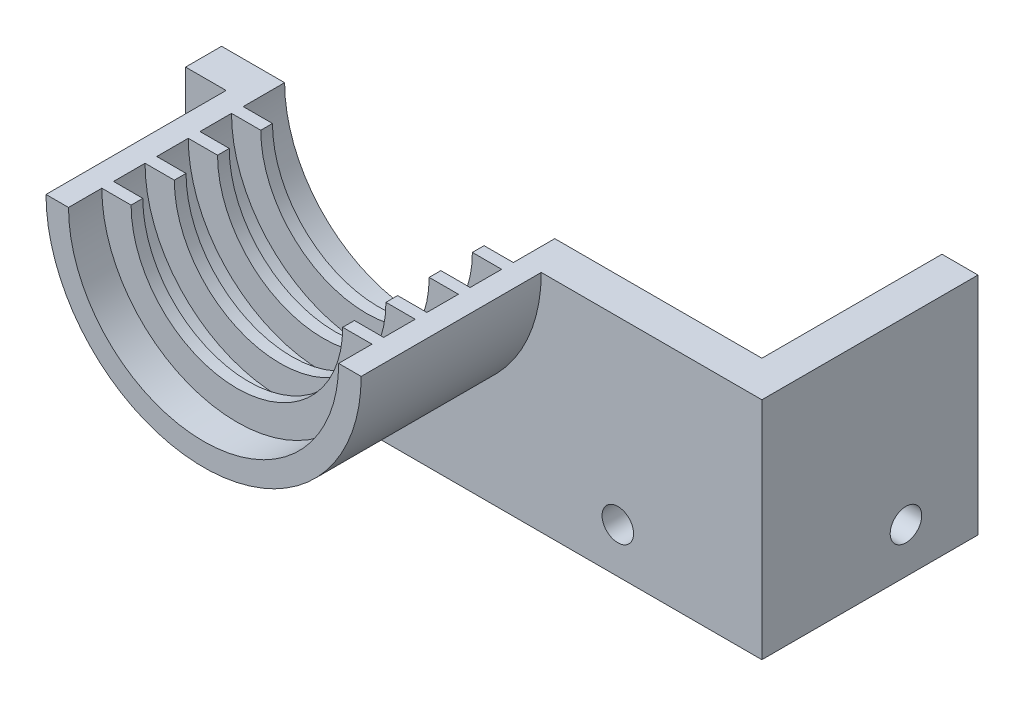
ISO-10303-21;
HEADER;
FILE_DESCRIPTION(('STEP AP214'),'2;1');
FILE_NAME('part.step','',(''),(''),'','','');
FILE_SCHEMA(('AUTOMOTIVE_DESIGN { 1 0 10303 214 1 1 1 1 }'));
ENDSEC;
DATA;
#1=APPLICATION_CONTEXT('core data for automotive mechanical design processes');
#2=APPLICATION_PROTOCOL_DEFINITION('international standard','automotive_design',2000,#1);
#3=PRODUCT_CONTEXT('',#1,'mechanical');
#4=PRODUCT('Part','Part','',(#3));
#5=PRODUCT_RELATED_PRODUCT_CATEGORY('part','',(#4));
#6=PRODUCT_DEFINITION_FORMATION('','',#4);
#7=PRODUCT_DEFINITION_CONTEXT('part definition',#1,'design');
#8=PRODUCT_DEFINITION('design','',#6,#7);
#9=PRODUCT_DEFINITION_SHAPE('','',#8);
#10=(LENGTH_UNIT() NAMED_UNIT(*) SI_UNIT(.MILLI.,.METRE.));
#11=(NAMED_UNIT(*) PLANE_ANGLE_UNIT() SI_UNIT($,.RADIAN.));
#12=(NAMED_UNIT(*) SI_UNIT($,.STERADIAN.) SOLID_ANGLE_UNIT());
#13=UNCERTAINTY_MEASURE_WITH_UNIT(LENGTH_MEASURE(1.E-05),#10,'distance_accuracy_value','');
#14=(GEOMETRIC_REPRESENTATION_CONTEXT(3) GLOBAL_UNCERTAINTY_ASSIGNED_CONTEXT((#13)) GLOBAL_UNIT_ASSIGNED_CONTEXT((#10,
#11,#12)) REPRESENTATION_CONTEXT('',''));
#15=CARTESIAN_POINT('',(0.,0.,0.));
#16=DIRECTION('',(0.,0.,1.));
#17=DIRECTION('',(1.,0.,0.));
#18=AXIS2_PLACEMENT_3D('',#15,#16,#17);
#19=CARTESIAN_POINT('',(0.,33.,4.));
#20=DIRECTION('',(0.,-1.,0.));
#21=DIRECTION('',(0.,0.,-1.));
#22=AXIS2_PLACEMENT_3D('',#19,#20,#21);
#23=PLANE('',#22);
#24=DIRECTION('',(-1.,0.,0.));
#25=VECTOR('',#24,1.);
#26=CARTESIAN_POINT('',(0.,33.,4.));
#27=LINE('',#26,#25);
#28=CARTESIAN_POINT('',(75.,33.,4.));
#29=VERTEX_POINT('',#28);
#30=CARTESIAN_POINT('',(50.5,33.,4.));
#31=VERTEX_POINT('',#30);
#32=EDGE_CURVE('E41',#29,#31,#27,.T.);
#33=ORIENTED_EDGE('',*,*,#32,.F.);
#34=DIRECTION('',(0.,0.,1.));
#35=VECTOR('',#34,1.);
#36=CARTESIAN_POINT('',(75.,33.,4.));
#37=LINE('',#36,#35);
#38=CARTESIAN_POINT('',(75.,33.,-20.));
#39=VERTEX_POINT('',#38);
#40=EDGE_CURVE('E401',#39,#29,#37,.T.);
#41=ORIENTED_EDGE('',*,*,#40,.F.);
#42=DIRECTION('',(1.,0.,0.));
#43=VECTOR('',#42,1.);
#44=CARTESIAN_POINT('',(75.,33.,-20.));
#45=LINE('',#44,#43);
#46=CARTESIAN_POINT('',(71.,33.,-20.));
#47=VERTEX_POINT('',#46);
#48=EDGE_CURVE('E389',#47,#39,#45,.T.);
#49=ORIENTED_EDGE('',*,*,#48,.F.);
#50=DIRECTION('',(0.,0.,1.));
#51=VECTOR('',#50,1.);
#52=CARTESIAN_POINT('',(71.,33.,-20.));
#53=LINE('',#52,#51);
#54=CARTESIAN_POINT('',(71.,33.,0.));
#55=VERTEX_POINT('',#54);
#56=EDGE_CURVE('E392',#47,#55,#53,.T.);
#57=ORIENTED_EDGE('',*,*,#56,.T.);
#58=DIRECTION('',(-1.,0.,0.));
#59=VECTOR('',#58,1.);
#60=CARTESIAN_POINT('',(0.,33.,0.));
#61=LINE('',#60,#59);
#62=CARTESIAN_POINT('',(48.,33.,0.));
#63=VERTEX_POINT('',#62);
#64=EDGE_CURVE('E364',#55,#63,#61,.T.);
#65=ORIENTED_EDGE('',*,*,#64,.T.);
#66=DIRECTION('',(0.,0.,1.));
#67=VECTOR('',#66,1.);
#68=CARTESIAN_POINT('',(48.,33.,0.));
#69=LINE('',#68,#67);
#70=CARTESIAN_POINT('',(48.,33.,4.6));
#71=VERTEX_POINT('',#70);
#72=EDGE_CURVE('E359',#63,#71,#69,.T.);
#73=ORIENTED_EDGE('',*,*,#72,.T.);
#74=DIRECTION('',(-1.,0.,0.));
#75=VECTOR('',#74,1.);
#76=CARTESIAN_POINT('',(44.75,33.,4.6));
#77=LINE('',#76,#75);
#78=CARTESIAN_POINT('',(44.75,33.,4.6));
#79=VERTEX_POINT('',#78);
#80=EDGE_CURVE('E320',#71,#79,#77,.T.);
#81=ORIENTED_EDGE('',*,*,#80,.T.);
#82=DIRECTION('',(0.,0.,-1.));
#83=VECTOR('',#82,1.);
#84=CARTESIAN_POINT('',(44.75,33.,5.9));
#85=LINE('',#84,#83);
#86=CARTESIAN_POINT('',(44.75,33.,5.9));
#87=VERTEX_POINT('',#86);
#88=EDGE_CURVE('E328',#87,#79,#85,.T.);
#89=ORIENTED_EDGE('',*,*,#88,.F.);
#90=DIRECTION('',(-1.,0.,0.));
#91=VECTOR('',#90,1.);
#92=CARTESIAN_POINT('',(44.75,33.,5.9));
#93=LINE('',#92,#91);
#94=CARTESIAN_POINT('',(48.,33.,5.9));
#95=VERTEX_POINT('',#94);
#96=EDGE_CURVE('E310',#95,#87,#93,.T.);
#97=ORIENTED_EDGE('',*,*,#96,.F.);
#98=CARTESIAN_POINT('',(48.,33.,9.4));
#99=VERTEX_POINT('',#98);
#100=EDGE_CURVE('E362',#95,#99,#69,.T.);
#101=ORIENTED_EDGE('',*,*,#100,.T.);
#102=DIRECTION('',(-1.,0.,0.));
#103=VECTOR('',#102,1.);
#104=CARTESIAN_POINT('',(44.75,33.,9.4));
#105=LINE('',#104,#103);
#106=CARTESIAN_POINT('',(44.75,33.,9.4));
#107=VERTEX_POINT('',#106);
#108=EDGE_CURVE('E295',#99,#107,#105,.T.);
#109=ORIENTED_EDGE('',*,*,#108,.T.);
#110=DIRECTION('',(0.,0.,-1.));
#111=VECTOR('',#110,1.);
#112=CARTESIAN_POINT('',(44.75,33.,10.7));
#113=LINE('',#112,#111);
#114=CARTESIAN_POINT('',(44.75,33.,10.7));
#115=VERTEX_POINT('',#114);
#116=EDGE_CURVE('E303',#115,#107,#113,.T.);
#117=ORIENTED_EDGE('',*,*,#116,.F.);
#118=DIRECTION('',(-1.,0.,0.));
#119=VECTOR('',#118,1.);
#120=CARTESIAN_POINT('',(44.75,33.,10.7));
#121=LINE('',#120,#119);
#122=CARTESIAN_POINT('',(48.,33.,10.7));
#123=VERTEX_POINT('',#122);
#124=EDGE_CURVE('E285',#123,#115,#121,.T.);
#125=ORIENTED_EDGE('',*,*,#124,.F.);
#126=CARTESIAN_POINT('',(48.,33.,14.2));
#127=VERTEX_POINT('',#126);
#128=EDGE_CURVE('E790',#123,#127,#69,.T.);
#129=ORIENTED_EDGE('',*,*,#128,.T.);
#130=DIRECTION('',(-1.,0.,0.));
#131=VECTOR('',#130,1.);
#132=CARTESIAN_POINT('',(44.75,33.,14.2));
#133=LINE('',#132,#131);
#134=CARTESIAN_POINT('',(44.75,33.,14.2));
#135=VERTEX_POINT('',#134);
#136=EDGE_CURVE('E270',#127,#135,#133,.T.);
#137=ORIENTED_EDGE('',*,*,#136,.T.);
#138=DIRECTION('',(0.,0.,-1.));
#139=VECTOR('',#138,1.);
#140=CARTESIAN_POINT('',(44.75,33.,15.5));
#141=LINE('',#140,#139);
#142=CARTESIAN_POINT('',(44.75,33.,15.5));
#143=VERTEX_POINT('',#142);
#144=EDGE_CURVE('E278',#143,#135,#141,.T.);
#145=ORIENTED_EDGE('',*,*,#144,.F.);
#146=DIRECTION('',(-1.,0.,0.));
#147=VECTOR('',#146,1.);
#148=CARTESIAN_POINT('',(44.75,33.,15.5));
#149=LINE('',#148,#147);
#150=CARTESIAN_POINT('',(48.,33.,15.5));
#151=VERTEX_POINT('',#150);
#152=EDGE_CURVE('E260',#151,#143,#149,.T.);
#153=ORIENTED_EDGE('',*,*,#152,.F.);
#154=CARTESIAN_POINT('',(48.,33.,19.));
#155=VERTEX_POINT('',#154);
#156=EDGE_CURVE('E782',#151,#155,#69,.T.);
#157=ORIENTED_EDGE('',*,*,#156,.T.);
#158=DIRECTION('',(-1.,0.,0.));
#159=VECTOR('',#158,1.);
#160=CARTESIAN_POINT('',(44.75,33.,19.));
#161=LINE('',#160,#159);
#162=CARTESIAN_POINT('',(44.75,33.,19.));
#163=VERTEX_POINT('',#162);
#164=EDGE_CURVE('E227',#155,#163,#161,.T.);
#165=ORIENTED_EDGE('',*,*,#164,.T.);
#166=DIRECTION('',(0.,0.,-1.));
#167=VECTOR('',#166,1.);
#168=CARTESIAN_POINT('',(44.75,33.,20.3));
#169=LINE('',#168,#167);
#170=CARTESIAN_POINT('',(44.75,33.,20.3));
#171=VERTEX_POINT('',#170);
#172=EDGE_CURVE('E253',#171,#163,#169,.T.);
#173=ORIENTED_EDGE('',*,*,#172,.F.);
#174=DIRECTION('',(-1.,0.,0.));
#175=VECTOR('',#174,1.);
#176=CARTESIAN_POINT('',(44.75,33.,20.3));
#177=LINE('',#176,#175);
#178=CARTESIAN_POINT('',(48.,33.,20.3));
#179=VERTEX_POINT('',#178);
#180=EDGE_CURVE('E237',#179,#171,#177,.T.);
#181=ORIENTED_EDGE('',*,*,#180,.F.);
#182=CARTESIAN_POINT('',(48.,33.,24.));
#183=VERTEX_POINT('',#182);
#184=EDGE_CURVE('E353',#179,#183,#69,.T.);
#185=ORIENTED_EDGE('',*,*,#184,.T.);
#186=DIRECTION('',(-1.,0.,0.));
#187=VECTOR('',#186,1.);
#188=CARTESIAN_POINT('',(48.,33.,24.));
#189=LINE('',#188,#187);
#190=CARTESIAN_POINT('',(50.5,33.,24.));
#191=VERTEX_POINT('',#190);
#192=EDGE_CURVE('E339',#191,#183,#189,.T.);
#193=ORIENTED_EDGE('',*,*,#192,.F.);
#194=DIRECTION('',(0.,0.,-1.));
#195=VECTOR('',#194,1.);
#196=CARTESIAN_POINT('',(50.5,33.,24.));
#197=LINE('',#196,#195);
#198=EDGE_CURVE('E342',#191,#31,#197,.T.);
#199=ORIENTED_EDGE('',*,*,#198,.T.);
#200=EDGE_LOOP('',(#33,#41,#49,#57,#65,#73,#81,#89,#97,#101,#109,#117,#125,#129,#137,#145,#153,
#157,#165,#173,#181,#185,#193,#199));
#201=FACE_BOUND('',#200,.T.);
#202=ADVANCED_FACE('F32',(#201),#23,.F.);
#203=CARTESIAN_POINT('',(0.,0.,4.));
#204=DIRECTION('',(0.,0.,-1.));
#205=DIRECTION('',(-1.,0.,0.));
#206=AXIS2_PLACEMENT_3D('',#203,#204,#205);
#207=PLANE('',#206);
#208=CARTESIAN_POINT('',(59.,13.,4.));
#209=DIRECTION('',(0.,0.,1.));
#210=DIRECTION('',(1.,0.,0.));
#211=AXIS2_PLACEMENT_3D('',#208,#209,#210);
#212=CIRCLE('',#211,1.75);
#213=CARTESIAN_POINT('',(60.75,13.,4.));
#214=VERTEX_POINT('',#213);
#215=EDGE_CURVE('E230',#214,#214,#212,.T.);
#216=ORIENTED_EDGE('',*,*,#215,.F.);
#217=EDGE_LOOP('',(#216));
#218=FACE_BOUND('',#217,.T.);
#219=CARTESIAN_POINT('',(15.5,33.,4.));
#220=VERTEX_POINT('',#219);
#221=CARTESIAN_POINT('',(11.,33.,4.));
#222=VERTEX_POINT('',#221);
#223=EDGE_CURVE('E218',#220,#222,#27,.T.);
#224=ORIENTED_EDGE('',*,*,#223,.T.);
#225=DIRECTION('',(0.,1.,0.));
#226=VECTOR('',#225,1.);
#227=CARTESIAN_POINT('',(11.,33.,4.));
#228=LINE('',#227,#226);
#229=CARTESIAN_POINT('',(11.,8.,4.));
#230=VERTEX_POINT('',#229);
#231=EDGE_CURVE('E49',#230,#222,#228,.T.);
#232=ORIENTED_EDGE('',*,*,#231,.F.);
#233=DIRECTION('',(-1.,0.,0.));
#234=VECTOR('',#233,1.);
#235=CARTESIAN_POINT('',(66.,8.,4.));
#236=LINE('',#235,#234);
#237=CARTESIAN_POINT('',(75.,8.,4.));
#238=VERTEX_POINT('',#237);
#239=EDGE_CURVE('E215',#238,#230,#236,.T.);
#240=ORIENTED_EDGE('',*,*,#239,.F.);
#241=DIRECTION('',(0.,-1.,0.));
#242=VECTOR('',#241,1.);
#243=CARTESIAN_POINT('',(75.,33.,4.));
#244=LINE('',#243,#242);
#245=EDGE_CURVE('E399',#29,#238,#244,.T.);
#246=ORIENTED_EDGE('',*,*,#245,.F.);
#247=ORIENTED_EDGE('',*,*,#32,.T.);
#248=CARTESIAN_POINT('',(33.,33.,4.));
#249=DIRECTION('',(0.,0.,1.));
#250=DIRECTION('',(1.,0.,0.));
#251=AXIS2_PLACEMENT_3D('',#248,#249,#250);
#252=CIRCLE('',#251,17.5);
#253=EDGE_CURVE('E331',#220,#31,#252,.T.);
#254=ORIENTED_EDGE('',*,*,#253,.F.);
#255=EDGE_LOOP('',(#224,#232,#240,#246,#247,#254));
#256=FACE_BOUND('',#255,.T.);
#257=ADVANCED_FACE('F213',(#218,#256),#207,.F.);
#258=CARTESIAN_POINT('',(0.,0.,0.));
#259=DIRECTION('',(0.,0.,-1.));
#260=DIRECTION('',(-1.,0.,0.));
#261=AXIS2_PLACEMENT_3D('',#258,#259,#260);
#262=PLANE('',#261);
#263=DIRECTION('',(0.,-1.,0.));
#264=VECTOR('',#263,1.);
#265=CARTESIAN_POINT('',(11.,0.,0.));
#266=LINE('',#265,#264);
#267=CARTESIAN_POINT('',(11.,33.,0.));
#268=VERTEX_POINT('',#267);
#269=CARTESIAN_POINT('',(11.,8.,0.));
#270=VERTEX_POINT('',#269);
#271=EDGE_CURVE('E207',#268,#270,#266,.T.);
#272=ORIENTED_EDGE('',*,*,#271,.F.);
#273=CARTESIAN_POINT('',(18.,33.,0.));
#274=VERTEX_POINT('',#273);
#275=EDGE_CURVE('E356',#274,#268,#61,.T.);
#276=ORIENTED_EDGE('',*,*,#275,.F.);
#277=CARTESIAN_POINT('',(33.,33.,0.));
#278=DIRECTION('',(0.,0.,1.));
#279=DIRECTION('',(1.,0.,0.));
#280=AXIS2_PLACEMENT_3D('',#277,#278,#279);
#281=CIRCLE('',#280,15.);
#282=EDGE_CURVE('E350',#274,#63,#281,.T.);
#283=ORIENTED_EDGE('',*,*,#282,.T.);
#284=ORIENTED_EDGE('',*,*,#64,.F.);
#285=DIRECTION('',(0.,1.,0.));
#286=VECTOR('',#285,1.);
#287=CARTESIAN_POINT('',(71.,33.,0.));
#288=LINE('',#287,#286);
#289=CARTESIAN_POINT('',(71.,8.,0.));
#290=VERTEX_POINT('',#289);
#291=EDGE_CURVE('E385',#290,#55,#288,.T.);
#292=ORIENTED_EDGE('',*,*,#291,.F.);
#293=DIRECTION('',(1.,0.,0.));
#294=VECTOR('',#293,1.);
#295=CARTESIAN_POINT('',(0.,7.99999999999999,0.));
#296=LINE('',#295,#294);
#297=EDGE_CURVE('E11',#270,#290,#296,.T.);
#298=ORIENTED_EDGE('',*,*,#297,.F.);
#299=EDGE_LOOP('',(#272,#276,#283,#284,#292,#298));
#300=FACE_BOUND('',#299,.T.);
#301=CARTESIAN_POINT('',(59.,13.,0.));
#302=DIRECTION('',(0.,0.,-1.));
#303=DIRECTION('',(-1.,0.,0.));
#304=AXIS2_PLACEMENT_3D('',#301,#302,#303);
#305=CIRCLE('',#304,1.75);
#306=CARTESIAN_POINT('',(57.25,13.,0.));
#307=VERTEX_POINT('',#306);
#308=EDGE_CURVE('E225',#307,#307,#305,.T.);
#309=ORIENTED_EDGE('',*,*,#308,.F.);
#310=EDGE_LOOP('',(#309));
#311=FACE_BOUND('',#310,.T.);
#312=ADVANCED_FACE('F373',(#300,#311),#262,.T.);
#313=CARTESIAN_POINT('',(66.,8.,-6.));
#314=DIRECTION('',(0.,1.,0.));
#315=DIRECTION('',(-1.,0.,0.));
#316=AXIS2_PLACEMENT_3D('',#313,#314,#315);
#317=PLANE('',#316);
#318=ORIENTED_EDGE('',*,*,#239,.T.);
#319=DIRECTION('',(0.,0.,1.));
#320=VECTOR('',#319,1.);
#321=CARTESIAN_POINT('',(11.,8.,-20.));
#322=LINE('',#321,#320);
#323=EDGE_CURVE('E204',#270,#230,#322,.T.);
#324=ORIENTED_EDGE('',*,*,#323,.F.);
#325=ORIENTED_EDGE('',*,*,#297,.T.);
#326=DIRECTION('',(0.,0.,1.));
#327=VECTOR('',#326,1.);
#328=CARTESIAN_POINT('',(71.,7.99999999999999,-20.));
#329=LINE('',#328,#327);
#330=CARTESIAN_POINT('',(71.,7.99999999999999,-20.));
#331=VERTEX_POINT('',#330);
#332=EDGE_CURVE('E396',#331,#290,#329,.T.);
#333=ORIENTED_EDGE('',*,*,#332,.F.);
#334=DIRECTION('',(-1.,0.,0.));
#335=VECTOR('',#334,1.);
#336=CARTESIAN_POINT('',(75.,7.99999999999999,-20.));
#337=LINE('',#336,#335);
#338=CARTESIAN_POINT('',(75.,7.99999999999999,-20.));
#339=VERTEX_POINT('',#338);
#340=EDGE_CURVE('E384',#339,#331,#337,.T.);
#341=ORIENTED_EDGE('',*,*,#340,.F.);
#342=DIRECTION('',(0.,0.,-1.));
#343=VECTOR('',#342,1.);
#344=CARTESIAN_POINT('',(75.,8.,4.));
#345=LINE('',#344,#343);
#346=EDGE_CURVE('E222',#238,#339,#345,.T.);
#347=ORIENTED_EDGE('',*,*,#346,.F.);
#348=EDGE_LOOP('',(#318,#324,#325,#333,#341,#347));
#349=FACE_BOUND('',#348,.T.);
#350=ADVANCED_FACE('F220',(#349),#317,.F.);
#351=CARTESIAN_POINT('',(33.,33.,0.));
#352=DIRECTION('',(0.,0.,1.));
#353=DIRECTION('',(1.,0.,0.));
#354=AXIS2_PLACEMENT_3D('',#351,#352,#353);
#355=CYLINDRICAL_SURFACE('',#354,15.);
#356=CARTESIAN_POINT('',(33.,33.,19.));
#357=DIRECTION('',(0.,0.,1.));
#358=DIRECTION('',(1.,0.,0.));
#359=AXIS2_PLACEMENT_3D('',#356,#357,#358);
#360=CIRCLE('',#359,15.);
#361=CARTESIAN_POINT('',(18.,33.,19.));
#362=VERTEX_POINT('',#361);
#363=EDGE_CURVE('E224',#362,#155,#360,.T.);
#364=ORIENTED_EDGE('',*,*,#363,.T.);
#365=ORIENTED_EDGE('',*,*,#156,.F.);
#366=CARTESIAN_POINT('',(33.,33.,15.5));
#367=DIRECTION('',(0.,0.,1.));
#368=DIRECTION('',(1.,0.,0.));
#369=AXIS2_PLACEMENT_3D('',#366,#367,#368);
#370=CIRCLE('',#369,15.);
#371=CARTESIAN_POINT('',(18.,33.,15.5));
#372=VERTEX_POINT('',#371);
#373=EDGE_CURVE('E257',#372,#151,#370,.T.);
#374=ORIENTED_EDGE('',*,*,#373,.F.);
#375=DIRECTION('',(0.,0.,1.));
#376=VECTOR('',#375,1.);
#377=CARTESIAN_POINT('',(18.,33.,0.));
#378=LINE('',#377,#376);
#379=EDGE_CURVE('E785',#372,#362,#378,.T.);
#380=ORIENTED_EDGE('',*,*,#379,.T.);
#381=EDGE_LOOP('',(#364,#365,#374,#380));
#382=FACE_BOUND('',#381,.T.);
#383=ADVANCED_FACE('F422',(#382),#355,.F.);
#384=CARTESIAN_POINT('',(33.,33.,14.2));
#385=DIRECTION('',(0.,0.,1.));
#386=DIRECTION('',(1.,0.,0.));
#387=AXIS2_PLACEMENT_3D('',#384,#385,#386);
#388=CIRCLE('',#387,15.);
#389=CARTESIAN_POINT('',(18.,33.,14.2));
#390=VERTEX_POINT('',#389);
#391=EDGE_CURVE('E256',#390,#127,#388,.T.);
#392=ORIENTED_EDGE('',*,*,#391,.T.);
#393=ORIENTED_EDGE('',*,*,#128,.F.);
#394=CARTESIAN_POINT('',(33.,33.,10.7));
#395=DIRECTION('',(0.,0.,1.));
#396=DIRECTION('',(1.,0.,0.));
#397=AXIS2_PLACEMENT_3D('',#394,#395,#396);
#398=CIRCLE('',#397,15.);
#399=CARTESIAN_POINT('',(18.,33.,10.7));
#400=VERTEX_POINT('',#399);
#401=EDGE_CURVE('E282',#400,#123,#398,.T.);
#402=ORIENTED_EDGE('',*,*,#401,.F.);
#403=EDGE_CURVE('E807',#400,#390,#378,.T.);
#404=ORIENTED_EDGE('',*,*,#403,.T.);
#405=EDGE_LOOP('',(#392,#393,#402,#404));
#406=FACE_BOUND('',#405,.T.);
#407=ADVANCED_FACE('F605',(#406),#355,.F.);
#408=CARTESIAN_POINT('',(33.,33.,9.4));
#409=DIRECTION('',(0.,0.,1.));
#410=DIRECTION('',(1.,0.,0.));
#411=AXIS2_PLACEMENT_3D('',#408,#409,#410);
#412=CIRCLE('',#411,15.);
#413=CARTESIAN_POINT('',(18.,33.,9.4));
#414=VERTEX_POINT('',#413);
#415=EDGE_CURVE('E281',#414,#99,#412,.T.);
#416=ORIENTED_EDGE('',*,*,#415,.T.);
#417=ORIENTED_EDGE('',*,*,#100,.F.);
#418=CARTESIAN_POINT('',(33.,33.,5.9));
#419=DIRECTION('',(0.,0.,1.));
#420=DIRECTION('',(1.,0.,0.));
#421=AXIS2_PLACEMENT_3D('',#418,#419,#420);
#422=CIRCLE('',#421,15.);
#423=CARTESIAN_POINT('',(18.,33.,5.9));
#424=VERTEX_POINT('',#423);
#425=EDGE_CURVE('E307',#424,#95,#422,.T.);
#426=ORIENTED_EDGE('',*,*,#425,.F.);
#427=EDGE_CURVE('E357',#424,#414,#378,.T.);
#428=ORIENTED_EDGE('',*,*,#427,.T.);
#429=EDGE_LOOP('',(#416,#417,#426,#428));
#430=FACE_BOUND('',#429,.T.);
#431=ADVANCED_FACE('F599',(#430),#355,.F.);
#432=CARTESIAN_POINT('',(33.,33.,4.6));
#433=DIRECTION('',(0.,0.,1.));
#434=DIRECTION('',(1.,0.,0.));
#435=AXIS2_PLACEMENT_3D('',#432,#433,#434);
#436=CIRCLE('',#435,15.);
#437=CARTESIAN_POINT('',(18.,33.,4.6));
#438=VERTEX_POINT('',#437);
#439=EDGE_CURVE('E306',#438,#71,#436,.T.);
#440=ORIENTED_EDGE('',*,*,#439,.T.);
#441=ORIENTED_EDGE('',*,*,#72,.F.);
#442=ORIENTED_EDGE('',*,*,#282,.F.);
#443=EDGE_CURVE('E354',#274,#438,#378,.T.);
#444=ORIENTED_EDGE('',*,*,#443,.T.);
#445=EDGE_LOOP('',(#440,#441,#442,#444));
#446=FACE_BOUND('',#445,.T.);
#447=ADVANCED_FACE('F423',(#446),#355,.F.);
#448=ORIENTED_EDGE('',*,*,#275,.T.);
#449=DIRECTION('',(0.,0.,1.));
#450=VECTOR('',#449,1.);
#451=CARTESIAN_POINT('',(11.,33.,-20.));
#452=LINE('',#451,#450);
#453=EDGE_CURVE('E209',#268,#222,#452,.T.);
#454=ORIENTED_EDGE('',*,*,#453,.T.);
#455=ORIENTED_EDGE('',*,*,#223,.F.);
#456=DIRECTION('',(0.,0.,-1.));
#457=VECTOR('',#456,1.);
#458=CARTESIAN_POINT('',(15.5,33.,24.));
#459=LINE('',#458,#457);
#460=CARTESIAN_POINT('',(15.5,33.,24.));
#461=VERTEX_POINT('',#460);
#462=EDGE_CURVE('E347',#461,#220,#459,.T.);
#463=ORIENTED_EDGE('',*,*,#462,.F.);
#464=DIRECTION('',(-1.,0.,0.));
#465=VECTOR('',#464,1.);
#466=CARTESIAN_POINT('',(18.,33.,24.));
#467=LINE('',#466,#465);
#468=CARTESIAN_POINT('',(18.,33.,24.));
#469=VERTEX_POINT('',#468);
#470=EDGE_CURVE('E335',#469,#461,#467,.T.);
#471=ORIENTED_EDGE('',*,*,#470,.F.);
#472=CARTESIAN_POINT('',(18.,33.,20.3));
#473=VERTEX_POINT('',#472);
#474=EDGE_CURVE('E358',#473,#469,#378,.T.);
#475=ORIENTED_EDGE('',*,*,#474,.F.);
#476=DIRECTION('',(-1.,0.,0.));
#477=VECTOR('',#476,1.);
#478=CARTESIAN_POINT('',(18.,33.,20.3));
#479=LINE('',#478,#477);
#480=CARTESIAN_POINT('',(21.25,33.,20.3));
#481=VERTEX_POINT('',#480);
#482=EDGE_CURVE('E242',#481,#473,#479,.T.);
#483=ORIENTED_EDGE('',*,*,#482,.F.);
#484=DIRECTION('',(0.,0.,-1.));
#485=VECTOR('',#484,1.);
#486=CARTESIAN_POINT('',(21.25,33.,20.3));
#487=LINE('',#486,#485);
#488=CARTESIAN_POINT('',(21.25,33.,19.));
#489=VERTEX_POINT('',#488);
#490=EDGE_CURVE('E244',#481,#489,#487,.T.);
#491=ORIENTED_EDGE('',*,*,#490,.T.);
#492=DIRECTION('',(-1.,0.,0.));
#493=VECTOR('',#492,1.);
#494=CARTESIAN_POINT('',(18.,33.,19.));
#495=LINE('',#494,#493);
#496=EDGE_CURVE('E238',#489,#362,#495,.T.);
#497=ORIENTED_EDGE('',*,*,#496,.T.);
#498=ORIENTED_EDGE('',*,*,#379,.F.);
#499=DIRECTION('',(-1.,0.,0.));
#500=VECTOR('',#499,1.);
#501=CARTESIAN_POINT('',(18.,33.,15.5));
#502=LINE('',#501,#500);
#503=CARTESIAN_POINT('',(21.25,33.,15.5));
#504=VERTEX_POINT('',#503);
#505=EDGE_CURVE('E265',#504,#372,#502,.T.);
#506=ORIENTED_EDGE('',*,*,#505,.F.);
#507=DIRECTION('',(0.,0.,-1.));
#508=VECTOR('',#507,1.);
#509=CARTESIAN_POINT('',(21.25,33.,15.5));
#510=LINE('',#509,#508);
#511=CARTESIAN_POINT('',(21.25,33.,14.2));
#512=VERTEX_POINT('',#511);
#513=EDGE_CURVE('E268',#504,#512,#510,.T.);
#514=ORIENTED_EDGE('',*,*,#513,.T.);
#515=DIRECTION('',(-1.,0.,0.));
#516=VECTOR('',#515,1.);
#517=CARTESIAN_POINT('',(18.,33.,14.2));
#518=LINE('',#517,#516);
#519=EDGE_CURVE('E261',#512,#390,#518,.T.);
#520=ORIENTED_EDGE('',*,*,#519,.T.);
#521=ORIENTED_EDGE('',*,*,#403,.F.);
#522=DIRECTION('',(-1.,0.,0.));
#523=VECTOR('',#522,1.);
#524=CARTESIAN_POINT('',(18.,33.,10.7));
#525=LINE('',#524,#523);
#526=CARTESIAN_POINT('',(21.25,33.,10.7));
#527=VERTEX_POINT('',#526);
#528=EDGE_CURVE('E290',#527,#400,#525,.T.);
#529=ORIENTED_EDGE('',*,*,#528,.F.);
#530=DIRECTION('',(0.,0.,-1.));
#531=VECTOR('',#530,1.);
#532=CARTESIAN_POINT('',(21.25,33.,10.7));
#533=LINE('',#532,#531);
#534=CARTESIAN_POINT('',(21.25,33.,9.4));
#535=VERTEX_POINT('',#534);
#536=EDGE_CURVE('E293',#527,#535,#533,.T.);
#537=ORIENTED_EDGE('',*,*,#536,.T.);
#538=DIRECTION('',(-1.,0.,0.));
#539=VECTOR('',#538,1.);
#540=CARTESIAN_POINT('',(18.,33.,9.4));
#541=LINE('',#540,#539);
#542=EDGE_CURVE('E286',#535,#414,#541,.T.);
#543=ORIENTED_EDGE('',*,*,#542,.T.);
#544=ORIENTED_EDGE('',*,*,#427,.F.);
#545=DIRECTION('',(-1.,0.,0.));
#546=VECTOR('',#545,1.);
#547=CARTESIAN_POINT('',(18.,33.,5.9));
#548=LINE('',#547,#546);
#549=CARTESIAN_POINT('',(21.25,33.,5.9));
#550=VERTEX_POINT('',#549);
#551=EDGE_CURVE('E315',#550,#424,#548,.T.);
#552=ORIENTED_EDGE('',*,*,#551,.F.);
#553=DIRECTION('',(0.,0.,-1.));
#554=VECTOR('',#553,1.);
#555=CARTESIAN_POINT('',(21.25,33.,5.9));
#556=LINE('',#555,#554);
#557=CARTESIAN_POINT('',(21.25,33.,4.6));
#558=VERTEX_POINT('',#557);
#559=EDGE_CURVE('E318',#550,#558,#556,.T.);
#560=ORIENTED_EDGE('',*,*,#559,.T.);
#561=DIRECTION('',(-1.,0.,0.));
#562=VECTOR('',#561,1.);
#563=CARTESIAN_POINT('',(18.,33.,4.6));
#564=LINE('',#563,#562);
#565=EDGE_CURVE('E311',#558,#438,#564,.T.);
#566=ORIENTED_EDGE('',*,*,#565,.T.);
#567=ORIENTED_EDGE('',*,*,#443,.F.);
#568=EDGE_LOOP('',(#448,#454,#455,#463,#471,#475,#483,#491,#497,#498,#506,#514,#520,#521,#529,
#537,#543,#544,#552,#560,#566,#567));
#569=FACE_BOUND('',#568,.T.);
#570=ADVANCED_FACE('F34',(#569),#23,.F.);
#571=ORIENTED_EDGE('',*,*,#184,.F.);
#572=CARTESIAN_POINT('',(33.,33.,20.3));
#573=DIRECTION('',(0.,0.,1.));
#574=DIRECTION('',(1.,0.,0.));
#575=AXIS2_PLACEMENT_3D('',#572,#573,#574);
#576=CIRCLE('',#575,15.);
#577=EDGE_CURVE('E234',#473,#179,#576,.T.);
#578=ORIENTED_EDGE('',*,*,#577,.F.);
#579=ORIENTED_EDGE('',*,*,#474,.T.);
#580=CARTESIAN_POINT('',(33.,33.,24.));
#581=DIRECTION('',(0.,0.,-1.));
#582=DIRECTION('',(1.,0.,0.));
#583=AXIS2_PLACEMENT_3D('',#580,#581,#582);
#584=CIRCLE('',#583,15.);
#585=EDGE_CURVE('E332',#183,#469,#584,.T.);
#586=ORIENTED_EDGE('',*,*,#585,.F.);
#587=EDGE_LOOP('',(#571,#578,#579,#586));
#588=FACE_BOUND('',#587,.T.);
#589=ADVANCED_FACE('F417',(#588),#355,.F.);
#590=CARTESIAN_POINT('',(33.,33.,24.));
#591=DIRECTION('',(0.,0.,-1.));
#592=DIRECTION('',(-1.,0.,0.));
#593=AXIS2_PLACEMENT_3D('',#590,#591,#592);
#594=CYLINDRICAL_SURFACE('',#593,17.5);
#595=ORIENTED_EDGE('',*,*,#253,.T.);
#596=ORIENTED_EDGE('',*,*,#198,.F.);
#597=CARTESIAN_POINT('',(33.,33.,24.));
#598=DIRECTION('',(0.,0.,1.));
#599=DIRECTION('',(1.,0.,0.));
#600=AXIS2_PLACEMENT_3D('',#597,#598,#599);
#601=CIRCLE('',#600,17.5);
#602=EDGE_CURVE('E337',#461,#191,#601,.T.);
#603=ORIENTED_EDGE('',*,*,#602,.F.);
#604=ORIENTED_EDGE('',*,*,#462,.T.);
#605=EDGE_LOOP('',(#595,#596,#603,#604));
#606=FACE_BOUND('',#605,.T.);
#607=ADVANCED_FACE('F420',(#606),#594,.T.);
#608=CARTESIAN_POINT('',(33.,33.,24.));
#609=DIRECTION('',(0.,0.,1.));
#610=DIRECTION('',(1.,0.,0.));
#611=AXIS2_PLACEMENT_3D('',#608,#609,#610);
#612=PLANE('',#611);
#613=ORIENTED_EDGE('',*,*,#585,.T.);
#614=ORIENTED_EDGE('',*,*,#470,.T.);
#615=ORIENTED_EDGE('',*,*,#602,.T.);
#616=ORIENTED_EDGE('',*,*,#192,.T.);
#617=EDGE_LOOP('',(#613,#614,#615,#616));
#618=FACE_BOUND('',#617,.T.);
#619=ADVANCED_FACE('F426',(#618),#612,.T.);
#620=CARTESIAN_POINT('',(33.,33.,5.9));
#621=DIRECTION('',(0.,0.,-1.));
#622=DIRECTION('',(-1.,0.,0.));
#623=AXIS2_PLACEMENT_3D('',#620,#621,#622);
#624=CYLINDRICAL_SURFACE('',#623,11.75);
#625=CARTESIAN_POINT('',(33.,33.,4.6));
#626=DIRECTION('',(0.,0.,-1.));
#627=DIRECTION('',(1.,0.,0.));
#628=AXIS2_PLACEMENT_3D('',#625,#626,#627);
#629=CIRCLE('',#628,11.75);
#630=EDGE_CURVE('E322',#79,#558,#629,.T.);
#631=ORIENTED_EDGE('',*,*,#630,.T.);
#632=ORIENTED_EDGE('',*,*,#559,.F.);
#633=CARTESIAN_POINT('',(33.,33.,5.9));
#634=DIRECTION('',(0.,0.,-1.));
#635=DIRECTION('',(1.,0.,0.));
#636=AXIS2_PLACEMENT_3D('',#633,#634,#635);
#637=CIRCLE('',#636,11.75);
#638=EDGE_CURVE('E313',#87,#550,#637,.T.);
#639=ORIENTED_EDGE('',*,*,#638,.F.);
#640=ORIENTED_EDGE('',*,*,#88,.T.);
#641=EDGE_LOOP('',(#631,#632,#639,#640));
#642=FACE_BOUND('',#641,.T.);
#643=ADVANCED_FACE('F430',(#642),#624,.F.);
#644=CARTESIAN_POINT('',(33.,33.,5.9));
#645=DIRECTION('',(0.,0.,1.));
#646=DIRECTION('',(1.,0.,0.));
#647=AXIS2_PLACEMENT_3D('',#644,#645,#646);
#648=PLANE('',#647);
#649=ORIENTED_EDGE('',*,*,#425,.T.);
#650=ORIENTED_EDGE('',*,*,#96,.T.);
#651=ORIENTED_EDGE('',*,*,#638,.T.);
#652=ORIENTED_EDGE('',*,*,#551,.T.);
#653=EDGE_LOOP('',(#649,#650,#651,#652));
#654=FACE_BOUND('',#653,.T.);
#655=ADVANCED_FACE('F434',(#654),#648,.T.);
#656=CARTESIAN_POINT('',(33.,33.,4.6));
#657=DIRECTION('',(0.,0.,1.));
#658=DIRECTION('',(1.,0.,0.));
#659=AXIS2_PLACEMENT_3D('',#656,#657,#658);
#660=PLANE('',#659);
#661=ORIENTED_EDGE('',*,*,#439,.F.);
#662=ORIENTED_EDGE('',*,*,#565,.F.);
#663=ORIENTED_EDGE('',*,*,#630,.F.);
#664=ORIENTED_EDGE('',*,*,#80,.F.);
#665=EDGE_LOOP('',(#661,#662,#663,#664));
#666=FACE_BOUND('',#665,.T.);
#667=ADVANCED_FACE('F436',(#666),#660,.F.);
#668=CARTESIAN_POINT('',(33.,33.,10.7));
#669=DIRECTION('',(0.,0.,-1.));
#670=DIRECTION('',(-1.,0.,0.));
#671=AXIS2_PLACEMENT_3D('',#668,#669,#670);
#672=CYLINDRICAL_SURFACE('',#671,11.75);
#673=CARTESIAN_POINT('',(33.,33.,9.4));
#674=DIRECTION('',(0.,0.,-1.));
#675=DIRECTION('',(1.,0.,0.));
#676=AXIS2_PLACEMENT_3D('',#673,#674,#675);
#677=CIRCLE('',#676,11.75);
#678=EDGE_CURVE('E297',#107,#535,#677,.T.);
#679=ORIENTED_EDGE('',*,*,#678,.T.);
#680=ORIENTED_EDGE('',*,*,#536,.F.);
#681=CARTESIAN_POINT('',(33.,33.,10.7));
#682=DIRECTION('',(0.,0.,-1.));
#683=DIRECTION('',(1.,0.,0.));
#684=AXIS2_PLACEMENT_3D('',#681,#682,#683);
#685=CIRCLE('',#684,11.75);
#686=EDGE_CURVE('E288',#115,#527,#685,.T.);
#687=ORIENTED_EDGE('',*,*,#686,.F.);
#688=ORIENTED_EDGE('',*,*,#116,.T.);
#689=EDGE_LOOP('',(#679,#680,#687,#688));
#690=FACE_BOUND('',#689,.T.);
#691=ADVANCED_FACE('F439',(#690),#672,.F.);
#692=CARTESIAN_POINT('',(33.,33.,10.7));
#693=DIRECTION('',(0.,0.,1.));
#694=DIRECTION('',(1.,0.,0.));
#695=AXIS2_PLACEMENT_3D('',#692,#693,#694);
#696=PLANE('',#695);
#697=ORIENTED_EDGE('',*,*,#401,.T.);
#698=ORIENTED_EDGE('',*,*,#124,.T.);
#699=ORIENTED_EDGE('',*,*,#686,.T.);
#700=ORIENTED_EDGE('',*,*,#528,.T.);
#701=EDGE_LOOP('',(#697,#698,#699,#700));
#702=FACE_BOUND('',#701,.T.);
#703=ADVANCED_FACE('F446',(#702),#696,.T.);
#704=CARTESIAN_POINT('',(33.,33.,9.4));
#705=DIRECTION('',(0.,0.,1.));
#706=DIRECTION('',(1.,0.,0.));
#707=AXIS2_PLACEMENT_3D('',#704,#705,#706);
#708=PLANE('',#707);
#709=ORIENTED_EDGE('',*,*,#415,.F.);
#710=ORIENTED_EDGE('',*,*,#542,.F.);
#711=ORIENTED_EDGE('',*,*,#678,.F.);
#712=ORIENTED_EDGE('',*,*,#108,.F.);
#713=EDGE_LOOP('',(#709,#710,#711,#712));
#714=FACE_BOUND('',#713,.T.);
#715=ADVANCED_FACE('F448',(#714),#708,.F.);
#716=CARTESIAN_POINT('',(33.,33.,15.5));
#717=DIRECTION('',(0.,0.,-1.));
#718=DIRECTION('',(-1.,0.,0.));
#719=AXIS2_PLACEMENT_3D('',#716,#717,#718);
#720=CYLINDRICAL_SURFACE('',#719,11.75);
#721=CARTESIAN_POINT('',(33.,33.,14.2));
#722=DIRECTION('',(0.,0.,-1.));
#723=DIRECTION('',(1.,0.,0.));
#724=AXIS2_PLACEMENT_3D('',#721,#722,#723);
#725=CIRCLE('',#724,11.75);
#726=EDGE_CURVE('E272',#135,#512,#725,.T.);
#727=ORIENTED_EDGE('',*,*,#726,.T.);
#728=ORIENTED_EDGE('',*,*,#513,.F.);
#729=CARTESIAN_POINT('',(33.,33.,15.5));
#730=DIRECTION('',(0.,0.,-1.));
#731=DIRECTION('',(1.,0.,0.));
#732=AXIS2_PLACEMENT_3D('',#729,#730,#731);
#733=CIRCLE('',#732,11.75);
#734=EDGE_CURVE('E263',#143,#504,#733,.T.);
#735=ORIENTED_EDGE('',*,*,#734,.F.);
#736=ORIENTED_EDGE('',*,*,#144,.T.);
#737=EDGE_LOOP('',(#727,#728,#735,#736));
#738=FACE_BOUND('',#737,.T.);
#739=ADVANCED_FACE('F451',(#738),#720,.F.);
#740=CARTESIAN_POINT('',(33.,33.,15.5));
#741=DIRECTION('',(0.,0.,1.));
#742=DIRECTION('',(1.,0.,0.));
#743=AXIS2_PLACEMENT_3D('',#740,#741,#742);
#744=PLANE('',#743);
#745=ORIENTED_EDGE('',*,*,#373,.T.);
#746=ORIENTED_EDGE('',*,*,#152,.T.);
#747=ORIENTED_EDGE('',*,*,#734,.T.);
#748=ORIENTED_EDGE('',*,*,#505,.T.);
#749=EDGE_LOOP('',(#745,#746,#747,#748));
#750=FACE_BOUND('',#749,.T.);
#751=ADVANCED_FACE('F458',(#750),#744,.T.);
#752=CARTESIAN_POINT('',(33.,33.,14.2));
#753=DIRECTION('',(0.,0.,1.));
#754=DIRECTION('',(1.,0.,0.));
#755=AXIS2_PLACEMENT_3D('',#752,#753,#754);
#756=PLANE('',#755);
#757=ORIENTED_EDGE('',*,*,#391,.F.);
#758=ORIENTED_EDGE('',*,*,#519,.F.);
#759=ORIENTED_EDGE('',*,*,#726,.F.);
#760=ORIENTED_EDGE('',*,*,#136,.F.);
#761=EDGE_LOOP('',(#757,#758,#759,#760));
#762=FACE_BOUND('',#761,.T.);
#763=ADVANCED_FACE('F460',(#762),#756,.F.);
#764=CARTESIAN_POINT('',(33.,33.,20.3));
#765=DIRECTION('',(0.,0.,-1.));
#766=DIRECTION('',(-1.,0.,0.));
#767=AXIS2_PLACEMENT_3D('',#764,#765,#766);
#768=CYLINDRICAL_SURFACE('',#767,11.75);
#769=CARTESIAN_POINT('',(33.,33.,19.));
#770=DIRECTION('',(0.,0.,-1.));
#771=DIRECTION('',(1.,0.,0.));
#772=AXIS2_PLACEMENT_3D('',#769,#770,#771);
#773=CIRCLE('',#772,11.75);
#774=EDGE_CURVE('E247',#163,#489,#773,.T.);
#775=ORIENTED_EDGE('',*,*,#774,.T.);
#776=ORIENTED_EDGE('',*,*,#490,.F.);
#777=CARTESIAN_POINT('',(33.,33.,20.3));
#778=DIRECTION('',(0.,0.,-1.));
#779=DIRECTION('',(1.,0.,0.));
#780=AXIS2_PLACEMENT_3D('',#777,#778,#779);
#781=CIRCLE('',#780,11.75);
#782=EDGE_CURVE('E240',#171,#481,#781,.T.);
#783=ORIENTED_EDGE('',*,*,#782,.F.);
#784=ORIENTED_EDGE('',*,*,#172,.T.);
#785=EDGE_LOOP('',(#775,#776,#783,#784));
#786=FACE_BOUND('',#785,.T.);
#787=ADVANCED_FACE('F463',(#786),#768,.F.);
#788=CARTESIAN_POINT('',(33.,33.,20.3));
#789=DIRECTION('',(0.,0.,1.));
#790=DIRECTION('',(1.,0.,0.));
#791=AXIS2_PLACEMENT_3D('',#788,#789,#790);
#792=PLANE('',#791);
#793=ORIENTED_EDGE('',*,*,#577,.T.);
#794=ORIENTED_EDGE('',*,*,#180,.T.);
#795=ORIENTED_EDGE('',*,*,#782,.T.);
#796=ORIENTED_EDGE('',*,*,#482,.T.);
#797=EDGE_LOOP('',(#793,#794,#795,#796));
#798=FACE_BOUND('',#797,.T.);
#799=ADVANCED_FACE('F470',(#798),#792,.T.);
#800=CARTESIAN_POINT('',(33.,33.,19.));
#801=DIRECTION('',(0.,0.,1.));
#802=DIRECTION('',(1.,0.,0.));
#803=AXIS2_PLACEMENT_3D('',#800,#801,#802);
#804=PLANE('',#803);
#805=ORIENTED_EDGE('',*,*,#363,.F.);
#806=ORIENTED_EDGE('',*,*,#496,.F.);
#807=ORIENTED_EDGE('',*,*,#774,.F.);
#808=ORIENTED_EDGE('',*,*,#164,.F.);
#809=EDGE_LOOP('',(#805,#806,#807,#808));
#810=FACE_BOUND('',#809,.T.);
#811=ADVANCED_FACE('F472',(#810),#804,.F.);
#812=CARTESIAN_POINT('',(59.,13.,-8.));
#813=DIRECTION('',(0.,0.,1.));
#814=DIRECTION('',(1.,0.,0.));
#815=AXIS2_PLACEMENT_3D('',#812,#813,#814);
#816=CYLINDRICAL_SURFACE('',#815,1.75);
#817=ORIENTED_EDGE('',*,*,#308,.T.);
#818=EDGE_LOOP('',(#817));
#819=FACE_BOUND('',#818,.T.);
#820=ORIENTED_EDGE('',*,*,#215,.T.);
#821=EDGE_LOOP('',(#820));
#822=FACE_BOUND('',#821,.T.);
#823=ADVANCED_FACE('F408',(#819,#822),#816,.F.);
#824=CARTESIAN_POINT('',(75.,0.,0.));
#825=DIRECTION('',(1.,0.,0.));
#826=DIRECTION('',(0.,0.,-1.));
#827=AXIS2_PLACEMENT_3D('',#824,#825,#826);
#828=PLANE('',#827);
#829=CARTESIAN_POINT('',(75.,13.,-12.));
#830=DIRECTION('',(1.,0.,0.));
#831=DIRECTION('',(0.,0.,-1.));
#832=AXIS2_PLACEMENT_3D('',#829,#830,#831);
#833=CIRCLE('',#832,1.75);
#834=CARTESIAN_POINT('',(75.,13.,-13.75));
#835=VERTEX_POINT('',#834);
#836=EDGE_CURVE('E375',#835,#835,#833,.T.);
#837=ORIENTED_EDGE('',*,*,#836,.F.);
#838=EDGE_LOOP('',(#837));
#839=FACE_BOUND('',#838,.T.);
#840=ORIENTED_EDGE('',*,*,#245,.T.);
#841=ORIENTED_EDGE('',*,*,#346,.T.);
#842=DIRECTION('',(0.,-1.,0.));
#843=VECTOR('',#842,1.);
#844=CARTESIAN_POINT('',(75.,33.,-20.));
#845=LINE('',#844,#843);
#846=EDGE_CURVE('E381',#39,#339,#845,.T.);
#847=ORIENTED_EDGE('',*,*,#846,.F.);
#848=ORIENTED_EDGE('',*,*,#40,.T.);
#849=EDGE_LOOP('',(#840,#841,#847,#848));
#850=FACE_BOUND('',#849,.T.);
#851=ADVANCED_FACE('F483',(#839,#850),#828,.T.);
#852=CARTESIAN_POINT('',(71.,33.,-20.));
#853=DIRECTION('',(1.,0.,0.));
#854=DIRECTION('',(0.,0.,-1.));
#855=AXIS2_PLACEMENT_3D('',#852,#853,#854);
#856=PLANE('',#855);
#857=CARTESIAN_POINT('',(71.,13.,-12.));
#858=DIRECTION('',(1.,0.,0.));
#859=DIRECTION('',(0.,0.,-1.));
#860=AXIS2_PLACEMENT_3D('',#857,#858,#859);
#861=CIRCLE('',#860,1.75);
#862=CARTESIAN_POINT('',(71.,13.,-13.75));
#863=VERTEX_POINT('',#862);
#864=EDGE_CURVE('E36',#863,#863,#861,.T.);
#865=ORIENTED_EDGE('',*,*,#864,.T.);
#866=EDGE_LOOP('',(#865));
#867=FACE_BOUND('',#866,.T.);
#868=ORIENTED_EDGE('',*,*,#291,.T.);
#869=ORIENTED_EDGE('',*,*,#56,.F.);
#870=DIRECTION('',(0.,1.,0.));
#871=VECTOR('',#870,1.);
#872=CARTESIAN_POINT('',(71.,33.,-20.));
#873=LINE('',#872,#871);
#874=EDGE_CURVE('E387',#331,#47,#873,.T.);
#875=ORIENTED_EDGE('',*,*,#874,.F.);
#876=ORIENTED_EDGE('',*,*,#332,.T.);
#877=EDGE_LOOP('',(#868,#869,#875,#876));
#878=FACE_BOUND('',#877,.T.);
#879=ADVANCED_FACE('F487',(#867,#878),#856,.F.);
#880=CARTESIAN_POINT('',(0.,0.,-20.));
#881=DIRECTION('',(0.,0.,-1.));
#882=DIRECTION('',(-1.,0.,0.));
#883=AXIS2_PLACEMENT_3D('',#880,#881,#882);
#884=PLANE('',#883);
#885=ORIENTED_EDGE('',*,*,#846,.T.);
#886=ORIENTED_EDGE('',*,*,#340,.T.);
#887=ORIENTED_EDGE('',*,*,#874,.T.);
#888=ORIENTED_EDGE('',*,*,#48,.T.);
#889=EDGE_LOOP('',(#885,#886,#887,#888));
#890=FACE_BOUND('',#889,.T.);
#891=ADVANCED_FACE('F491',(#890),#884,.T.);
#892=CARTESIAN_POINT('',(55.,13.,-12.));
#893=DIRECTION('',(1.,0.,0.));
#894=DIRECTION('',(0.,0.,-1.));
#895=AXIS2_PLACEMENT_3D('',#892,#893,#894);
#896=CYLINDRICAL_SURFACE('',#895,1.75);
#897=ORIENTED_EDGE('',*,*,#836,.T.);
#898=EDGE_LOOP('',(#897));
#899=FACE_BOUND('',#898,.T.);
#900=ORIENTED_EDGE('',*,*,#864,.F.);
#901=EDGE_LOOP('',(#900));
#902=FACE_BOUND('',#901,.T.);
#903=ADVANCED_FACE('F495',(#899,#902),#896,.F.);
#904=CARTESIAN_POINT('',(11.,33.,-20.));
#905=DIRECTION('',(1.,0.,0.));
#906=DIRECTION('',(0.,1.,0.));
#907=AXIS2_PLACEMENT_3D('',#904,#905,#906);
#908=PLANE('',#907);
#909=ORIENTED_EDGE('',*,*,#271,.T.);
#910=ORIENTED_EDGE('',*,*,#323,.T.);
#911=ORIENTED_EDGE('',*,*,#231,.T.);
#912=ORIENTED_EDGE('',*,*,#453,.F.);
#913=EDGE_LOOP('',(#909,#910,#911,#912));
#914=FACE_BOUND('',#913,.T.);
#915=ADVANCED_FACE('F205',(#914),#908,.F.);
#916=CLOSED_SHELL('',(#202,#257,#312,#350,#383,#407,#431,#447,#570,#589,#607,#619,#643,#655,
#667,#691,#703,#715,#739,#751,#763,#787,#799,#811,#823,#851,#879,#891,#903,#915));
#917=MANIFOLD_SOLID_BREP('B2',#916);
#918=ADVANCED_BREP_SHAPE_REPRESENTATION('',(#18,#917),#14);
#919=SHAPE_DEFINITION_REPRESENTATION(#9,#918);
ENDSEC;
END-ISO-10303-21;
